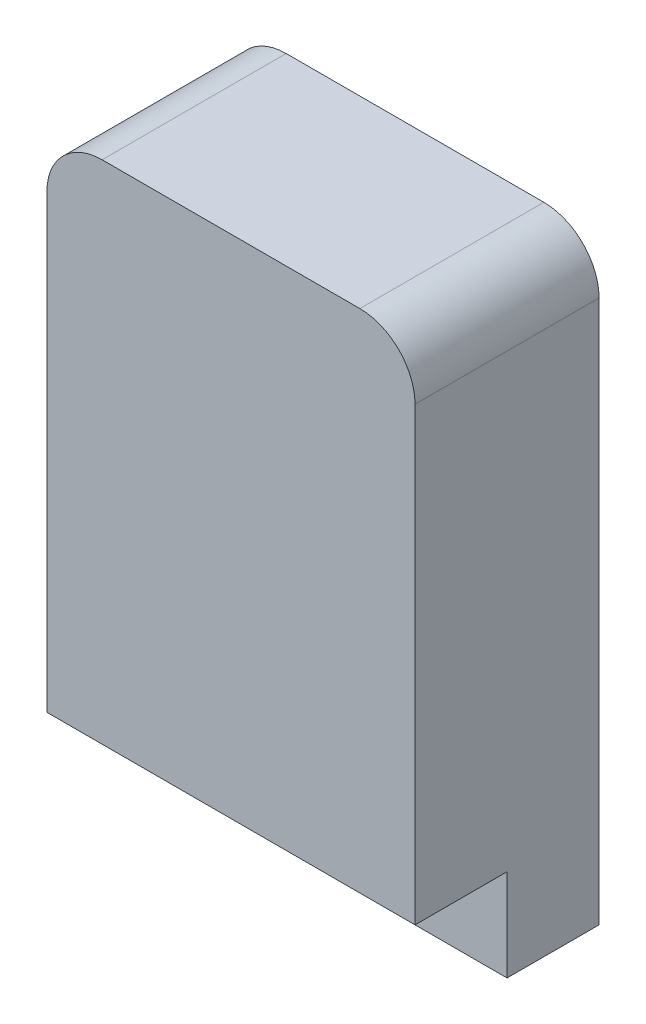
ISO-10303-21;
HEADER;
FILE_DESCRIPTION(('STEP AP214'),'2;1');
FILE_NAME('part.step','',(''),(''),'','','');
FILE_SCHEMA(('AUTOMOTIVE_DESIGN { 1 0 10303 214 1 1 1 1 }'));
ENDSEC;
DATA;
#1=APPLICATION_CONTEXT('core data for automotive mechanical design processes');
#2=APPLICATION_PROTOCOL_DEFINITION('international standard','automotive_design',2000,#1);
#3=PRODUCT_CONTEXT('',#1,'mechanical');
#4=PRODUCT('Part','Part','',(#3));
#5=PRODUCT_RELATED_PRODUCT_CATEGORY('part','',(#4));
#6=PRODUCT_DEFINITION_FORMATION('','',#4);
#7=PRODUCT_DEFINITION_CONTEXT('part definition',#1,'design');
#8=PRODUCT_DEFINITION('design','',#6,#7);
#9=PRODUCT_DEFINITION_SHAPE('','',#8);
#10=(LENGTH_UNIT() NAMED_UNIT(*) SI_UNIT(.MILLI.,.METRE.));
#11=(NAMED_UNIT(*) PLANE_ANGLE_UNIT() SI_UNIT($,.RADIAN.));
#12=(NAMED_UNIT(*) SI_UNIT($,.STERADIAN.) SOLID_ANGLE_UNIT());
#13=UNCERTAINTY_MEASURE_WITH_UNIT(LENGTH_MEASURE(1.E-05),#10,'distance_accuracy_value','');
#14=(GEOMETRIC_REPRESENTATION_CONTEXT(3) GLOBAL_UNCERTAINTY_ASSIGNED_CONTEXT((#13)) GLOBAL_UNIT_ASSIGNED_CONTEXT((#10,
#11,#12)) REPRESENTATION_CONTEXT('',''));
#15=CARTESIAN_POINT('',(0.,0.,0.));
#16=DIRECTION('',(0.,0.,1.));
#17=DIRECTION('',(1.,0.,0.));
#18=AXIS2_PLACEMENT_3D('',#15,#16,#17);
#19=CARTESIAN_POINT('',(0.,10.,10.));
#20=DIRECTION('',(0.,1.,0.));
#21=DIRECTION('',(0.,0.,1.));
#22=AXIS2_PLACEMENT_3D('',#19,#20,#21);
#23=PLANE('',#22);
#24=DIRECTION('',(1.,0.,0.));
#25=VECTOR('',#24,1.);
#26=CARTESIAN_POINT('',(0.,10.,0.));
#27=LINE('',#26,#25);
#28=CARTESIAN_POINT('',(-6.99999999999998,10.,0.));
#29=VERTEX_POINT('',#28);
#30=CARTESIAN_POINT('',(6.99999999999998,10.,0.));
#31=VERTEX_POINT('',#30);
#32=EDGE_CURVE('E124',#29,#31,#27,.T.);
#33=ORIENTED_EDGE('',*,*,#32,.F.);
#34=DIRECTION('',(0.,0.,-1.));
#35=VECTOR('',#34,1.);
#36=CARTESIAN_POINT('',(-6.99999999999998,10.,10.));
#37=LINE('',#36,#35);
#38=CARTESIAN_POINT('',(-6.99999999999998,10.,10.));
#39=VERTEX_POINT('',#38);
#40=EDGE_CURVE('E12',#39,#29,#37,.T.);
#41=ORIENTED_EDGE('',*,*,#40,.F.);
#42=DIRECTION('',(1.,0.,0.));
#43=VECTOR('',#42,1.);
#44=CARTESIAN_POINT('',(0.,10.,10.));
#45=LINE('',#44,#43);
#46=CARTESIAN_POINT('',(6.99999999999998,10.,10.));
#47=VERTEX_POINT('',#46);
#48=EDGE_CURVE('E138',#39,#47,#45,.T.);
#49=ORIENTED_EDGE('',*,*,#48,.T.);
#50=DIRECTION('',(0.,0.,-1.));
#51=VECTOR('',#50,1.);
#52=CARTESIAN_POINT('',(6.99999999999998,10.,10.));
#53=LINE('',#52,#51);
#54=EDGE_CURVE('E82',#47,#31,#53,.T.);
#55=ORIENTED_EDGE('',*,*,#54,.T.);
#56=EDGE_LOOP('',(#33,#41,#49,#55));
#57=FACE_BOUND('',#56,.T.);
#58=ADVANCED_FACE('F39',(#57),#23,.T.);
#59=CARTESIAN_POINT('',(-7.,7.,10.));
#60=DIRECTION('',(0.,0.,-1.));
#61=DIRECTION('',(-1.,0.,0.));
#62=AXIS2_PLACEMENT_3D('',#59,#60,#61);
#63=CYLINDRICAL_SURFACE('',#62,3.);
#64=CARTESIAN_POINT('',(-7.,7.,0.));
#65=DIRECTION('',(0.,0.,1.));
#66=DIRECTION('',(1.,0.,0.));
#67=AXIS2_PLACEMENT_3D('',#64,#65,#66);
#68=CIRCLE('',#67,3.);
#69=CARTESIAN_POINT('',(-10.,6.99999999999998,0.));
#70=VERTEX_POINT('',#69);
#71=EDGE_CURVE('E127',#29,#70,#68,.T.);
#72=ORIENTED_EDGE('',*,*,#71,.T.);
#73=DIRECTION('',(0.,0.,-1.));
#74=VECTOR('',#73,1.);
#75=CARTESIAN_POINT('',(-10.,6.99999999999998,10.));
#76=LINE('',#75,#74);
#77=CARTESIAN_POINT('',(-10.,6.99999999999998,10.));
#78=VERTEX_POINT('',#77);
#79=EDGE_CURVE('E46',#78,#70,#76,.T.);
#80=ORIENTED_EDGE('',*,*,#79,.F.);
#81=CARTESIAN_POINT('',(-7.,7.,10.));
#82=DIRECTION('',(0.,0.,1.));
#83=DIRECTION('',(1.,0.,0.));
#84=AXIS2_PLACEMENT_3D('',#81,#82,#83);
#85=CIRCLE('',#84,3.);
#86=EDGE_CURVE('E175',#39,#78,#85,.T.);
#87=ORIENTED_EDGE('',*,*,#86,.F.);
#88=ORIENTED_EDGE('',*,*,#40,.T.);
#89=EDGE_LOOP('',(#72,#80,#87,#88));
#90=FACE_BOUND('',#89,.T.);
#91=ADVANCED_FACE('F150',(#90),#63,.T.);
#92=CARTESIAN_POINT('',(-10.,0.,10.));
#93=DIRECTION('',(-1.,0.,0.));
#94=DIRECTION('',(0.,0.,1.));
#95=AXIS2_PLACEMENT_3D('',#92,#93,#94);
#96=PLANE('',#95);
#97=DIRECTION('',(0.,1.,0.));
#98=VECTOR('',#97,1.);
#99=CARTESIAN_POINT('',(-10.,0.,0.));
#100=LINE('',#99,#98);
#101=CARTESIAN_POINT('',(-10.,-22.5,0.));
#102=VERTEX_POINT('',#101);
#103=EDGE_CURVE('E131',#102,#70,#100,.T.);
#104=ORIENTED_EDGE('',*,*,#103,.F.);
#105=DIRECTION('',(0.,0.,-1.));
#106=VECTOR('',#105,1.);
#107=CARTESIAN_POINT('',(-10.,-22.5,5.));
#108=LINE('',#107,#106);
#109=CARTESIAN_POINT('',(-10.,-22.5,5.));
#110=VERTEX_POINT('',#109);
#111=EDGE_CURVE('E128',#110,#102,#108,.T.);
#112=ORIENTED_EDGE('',*,*,#111,.F.);
#113=DIRECTION('',(0.,-1.,0.));
#114=VECTOR('',#113,1.);
#115=CARTESIAN_POINT('',(-10.,0.,5.));
#116=LINE('',#115,#114);
#117=CARTESIAN_POINT('',(-10.,-17.5,5.));
#118=VERTEX_POINT('',#117);
#119=EDGE_CURVE('E219',#118,#110,#116,.T.);
#120=ORIENTED_EDGE('',*,*,#119,.F.);
#121=DIRECTION('',(0.,0.,-1.));
#122=VECTOR('',#121,1.);
#123=CARTESIAN_POINT('',(-10.,-17.5,10.));
#124=LINE('',#123,#122);
#125=CARTESIAN_POINT('',(-10.,-17.5,10.));
#126=VERTEX_POINT('',#125);
#127=EDGE_CURVE('E115',#126,#118,#124,.T.);
#128=ORIENTED_EDGE('',*,*,#127,.F.);
#129=DIRECTION('',(0.,1.,0.));
#130=VECTOR('',#129,1.);
#131=CARTESIAN_POINT('',(-10.,0.,10.));
#132=LINE('',#131,#130);
#133=EDGE_CURVE('E106',#126,#78,#132,.T.);
#134=ORIENTED_EDGE('',*,*,#133,.T.);
#135=ORIENTED_EDGE('',*,*,#79,.T.);
#136=EDGE_LOOP('',(#104,#112,#120,#128,#134,#135));
#137=FACE_BOUND('',#136,.T.);
#138=ADVANCED_FACE('F144',(#137),#96,.T.);
#139=CARTESIAN_POINT('',(0.,-17.5,10.));
#140=DIRECTION('',(0.,1.,0.));
#141=DIRECTION('',(0.,0.,1.));
#142=AXIS2_PLACEMENT_3D('',#139,#140,#141);
#143=PLANE('',#142);
#144=ORIENTED_EDGE('',*,*,#127,.T.);
#145=DIRECTION('',(1.,0.,0.));
#146=VECTOR('',#145,1.);
#147=CARTESIAN_POINT('',(0.,-17.5,5.));
#148=LINE('',#147,#146);
#149=CARTESIAN_POINT('',(10.,-17.5,5.));
#150=VERTEX_POINT('',#149);
#151=EDGE_CURVE('E113',#118,#150,#148,.T.);
#152=ORIENTED_EDGE('',*,*,#151,.T.);
#153=DIRECTION('',(0.,0.,-1.));
#154=VECTOR('',#153,1.);
#155=CARTESIAN_POINT('',(10.,-17.5,10.));
#156=LINE('',#155,#154);
#157=CARTESIAN_POINT('',(10.,-17.5,10.));
#158=VERTEX_POINT('',#157);
#159=EDGE_CURVE('E111',#158,#150,#156,.T.);
#160=ORIENTED_EDGE('',*,*,#159,.F.);
#161=DIRECTION('',(1.,0.,0.));
#162=VECTOR('',#161,1.);
#163=CARTESIAN_POINT('',(0.,-17.5,10.));
#164=LINE('',#163,#162);
#165=EDGE_CURVE('E99',#126,#158,#164,.T.);
#166=ORIENTED_EDGE('',*,*,#165,.F.);
#167=EDGE_LOOP('',(#144,#152,#160,#166));
#168=FACE_BOUND('',#167,.T.);
#169=ADVANCED_FACE('F112',(#168),#143,.F.);
#170=CARTESIAN_POINT('',(10.,0.,10.));
#171=DIRECTION('',(-1.,0.,0.));
#172=DIRECTION('',(0.,0.,1.));
#173=AXIS2_PLACEMENT_3D('',#170,#171,#172);
#174=PLANE('',#173);
#175=DIRECTION('',(0.,1.,0.));
#176=VECTOR('',#175,1.);
#177=CARTESIAN_POINT('',(10.,0.,0.));
#178=LINE('',#177,#176);
#179=CARTESIAN_POINT('',(10.,-22.5,0.));
#180=VERTEX_POINT('',#179);
#181=CARTESIAN_POINT('',(10.,6.99999999999998,0.));
#182=VERTEX_POINT('',#181);
#183=EDGE_CURVE('E134',#180,#182,#178,.T.);
#184=ORIENTED_EDGE('',*,*,#183,.T.);
#185=DIRECTION('',(0.,0.,-1.));
#186=VECTOR('',#185,1.);
#187=CARTESIAN_POINT('',(10.,6.99999999999998,10.));
#188=LINE('',#187,#186);
#189=CARTESIAN_POINT('',(10.,6.99999999999998,10.));
#190=VERTEX_POINT('',#189);
#191=EDGE_CURVE('E116',#190,#182,#188,.T.);
#192=ORIENTED_EDGE('',*,*,#191,.F.);
#193=DIRECTION('',(0.,1.,0.));
#194=VECTOR('',#193,1.);
#195=CARTESIAN_POINT('',(10.,0.,10.));
#196=LINE('',#195,#194);
#197=EDGE_CURVE('E103',#158,#190,#196,.T.);
#198=ORIENTED_EDGE('',*,*,#197,.F.);
#199=ORIENTED_EDGE('',*,*,#159,.T.);
#200=DIRECTION('',(0.,-1.,0.));
#201=VECTOR('',#200,1.);
#202=CARTESIAN_POINT('',(10.,0.,5.));
#203=LINE('',#202,#201);
#204=CARTESIAN_POINT('',(10.,-22.5,5.));
#205=VERTEX_POINT('',#204);
#206=EDGE_CURVE('E53',#150,#205,#203,.T.);
#207=ORIENTED_EDGE('',*,*,#206,.T.);
#208=DIRECTION('',(0.,0.,-1.));
#209=VECTOR('',#208,1.);
#210=CARTESIAN_POINT('',(10.,-22.5,5.));
#211=LINE('',#210,#209);
#212=EDGE_CURVE('E171',#205,#180,#211,.T.);
#213=ORIENTED_EDGE('',*,*,#212,.T.);
#214=EDGE_LOOP('',(#184,#192,#198,#199,#207,#213));
#215=FACE_BOUND('',#214,.T.);
#216=ADVANCED_FACE('F118',(#215),#174,.F.);
#217=CARTESIAN_POINT('',(7.,7.,10.));
#218=DIRECTION('',(0.,0.,-1.));
#219=DIRECTION('',(-1.,0.,0.));
#220=AXIS2_PLACEMENT_3D('',#217,#218,#219);
#221=CYLINDRICAL_SURFACE('',#220,3.);
#222=CARTESIAN_POINT('',(7.,7.,0.));
#223=DIRECTION('',(0.,0.,1.));
#224=DIRECTION('',(1.,0.,0.));
#225=AXIS2_PLACEMENT_3D('',#222,#223,#224);
#226=CIRCLE('',#225,3.);
#227=EDGE_CURVE('E136',#182,#31,#226,.T.);
#228=ORIENTED_EDGE('',*,*,#227,.T.);
#229=ORIENTED_EDGE('',*,*,#54,.F.);
#230=CARTESIAN_POINT('',(7.,7.,10.));
#231=DIRECTION('',(0.,0.,1.));
#232=DIRECTION('',(1.,0.,0.));
#233=AXIS2_PLACEMENT_3D('',#230,#231,#232);
#234=CIRCLE('',#233,3.);
#235=EDGE_CURVE('E62',#190,#47,#234,.T.);
#236=ORIENTED_EDGE('',*,*,#235,.F.);
#237=ORIENTED_EDGE('',*,*,#191,.T.);
#238=EDGE_LOOP('',(#228,#229,#236,#237));
#239=FACE_BOUND('',#238,.T.);
#240=ADVANCED_FACE('F189',(#239),#221,.T.);
#241=CARTESIAN_POINT('',(0.,0.,10.));
#242=DIRECTION('',(0.,0.,1.));
#243=DIRECTION('',(1.,0.,0.));
#244=AXIS2_PLACEMENT_3D('',#241,#242,#243);
#245=PLANE('',#244);
#246=ORIENTED_EDGE('',*,*,#48,.F.);
#247=ORIENTED_EDGE('',*,*,#86,.T.);
#248=ORIENTED_EDGE('',*,*,#133,.F.);
#249=ORIENTED_EDGE('',*,*,#165,.T.);
#250=ORIENTED_EDGE('',*,*,#197,.T.);
#251=ORIENTED_EDGE('',*,*,#235,.T.);
#252=EDGE_LOOP('',(#246,#247,#248,#249,#250,#251));
#253=FACE_BOUND('',#252,.T.);
#254=ADVANCED_FACE('F101',(#253),#245,.T.);
#255=CARTESIAN_POINT('',(0.,0.,0.));
#256=DIRECTION('',(0.,0.,1.));
#257=DIRECTION('',(1.,0.,0.));
#258=AXIS2_PLACEMENT_3D('',#255,#256,#257);
#259=PLANE('',#258);
#260=CARTESIAN_POINT('',(0.,0.,0.));
#261=DIRECTION('',(0.,0.,1.));
#262=DIRECTION('',(1.,0.,0.));
#263=AXIS2_PLACEMENT_3D('',#260,#261,#262);
#264=CIRCLE('',#263,7.5);
#265=CARTESIAN_POINT('',(7.5,0.,0.));
#266=VERTEX_POINT('',#265);
#267=EDGE_CURVE('E165',#266,#266,#264,.T.);
#268=ORIENTED_EDGE('',*,*,#267,.T.);
#269=EDGE_LOOP('',(#268));
#270=FACE_BOUND('',#269,.T.);
#271=ORIENTED_EDGE('',*,*,#32,.T.);
#272=ORIENTED_EDGE('',*,*,#227,.F.);
#273=ORIENTED_EDGE('',*,*,#183,.F.);
#274=DIRECTION('',(1.,0.,0.));
#275=VECTOR('',#274,1.);
#276=CARTESIAN_POINT('',(0.,-22.5,0.));
#277=LINE('',#276,#275);
#278=EDGE_CURVE('E156',#102,#180,#277,.T.);
#279=ORIENTED_EDGE('',*,*,#278,.F.);
#280=ORIENTED_EDGE('',*,*,#103,.T.);
#281=ORIENTED_EDGE('',*,*,#71,.F.);
#282=EDGE_LOOP('',(#271,#272,#273,#279,#280,#281));
#283=FACE_BOUND('',#282,.T.);
#284=ADVANCED_FACE('F153',(#270,#283),#259,.F.);
#285=CARTESIAN_POINT('',(0.,-22.5,5.));
#286=DIRECTION('',(0.,1.,0.));
#287=DIRECTION('',(0.,0.,1.));
#288=AXIS2_PLACEMENT_3D('',#285,#286,#287);
#289=PLANE('',#288);
#290=ORIENTED_EDGE('',*,*,#278,.T.);
#291=ORIENTED_EDGE('',*,*,#212,.F.);
#292=DIRECTION('',(1.,0.,0.));
#293=VECTOR('',#292,1.);
#294=CARTESIAN_POINT('',(0.,-22.5,5.));
#295=LINE('',#294,#293);
#296=EDGE_CURVE('E169',#110,#205,#295,.T.);
#297=ORIENTED_EDGE('',*,*,#296,.F.);
#298=ORIENTED_EDGE('',*,*,#111,.T.);
#299=EDGE_LOOP('',(#290,#291,#297,#298));
#300=FACE_BOUND('',#299,.T.);
#301=ADVANCED_FACE('F195',(#300),#289,.F.);
#302=CARTESIAN_POINT('',(0.,0.,5.));
#303=DIRECTION('',(0.,0.,1.));
#304=DIRECTION('',(1.,0.,0.));
#305=AXIS2_PLACEMENT_3D('',#302,#303,#304);
#306=PLANE('',#305);
#307=ORIENTED_EDGE('',*,*,#206,.F.);
#308=ORIENTED_EDGE('',*,*,#151,.F.);
#309=ORIENTED_EDGE('',*,*,#119,.T.);
#310=ORIENTED_EDGE('',*,*,#296,.T.);
#311=EDGE_LOOP('',(#307,#308,#309,#310));
#312=FACE_BOUND('',#311,.T.);
#313=ADVANCED_FACE('F201',(#312),#306,.T.);
#314=CARTESIAN_POINT('',(0.,0.,5.));
#315=DIRECTION('',(0.,0.,-1.));
#316=DIRECTION('',(-1.,0.,0.));
#317=AXIS2_PLACEMENT_3D('',#314,#315,#316);
#318=CYLINDRICAL_SURFACE('',#317,7.5);
#319=CARTESIAN_POINT('',(0.,0.,5.));
#320=DIRECTION('',(0.,0.,1.));
#321=DIRECTION('',(1.,0.,0.));
#322=AXIS2_PLACEMENT_3D('',#319,#320,#321);
#323=CIRCLE('',#322,7.5);
#324=CARTESIAN_POINT('',(7.5,0.,5.));
#325=VERTEX_POINT('',#324);
#326=EDGE_CURVE('E161',#325,#325,#323,.T.);
#327=ORIENTED_EDGE('',*,*,#326,.T.);
#328=EDGE_LOOP('',(#327));
#329=FACE_BOUND('',#328,.T.);
#330=ORIENTED_EDGE('',*,*,#267,.F.);
#331=EDGE_LOOP('',(#330));
#332=FACE_BOUND('',#331,.T.);
#333=ADVANCED_FACE('F204',(#329,#332),#318,.F.);
#334=CARTESIAN_POINT('',(0.,0.,5.));
#335=DIRECTION('',(0.,0.,1.));
#336=DIRECTION('',(1.,0.,0.));
#337=AXIS2_PLACEMENT_3D('',#334,#335,#336);
#338=PLANE('',#337);
#339=ORIENTED_EDGE('',*,*,#326,.F.);
#340=EDGE_LOOP('',(#339));
#341=FACE_BOUND('',#340,.T.);
#342=ADVANCED_FACE('F207',(#341),#338,.F.);
#343=CLOSED_SHELL('',(#58,#91,#138,#169,#216,#240,#254,#284,#301,#313,#333,#342));
#344=MANIFOLD_SOLID_BREP('B2',#343);
#345=ADVANCED_BREP_SHAPE_REPRESENTATION('',(#18,#344),#14);
#346=SHAPE_DEFINITION_REPRESENTATION(#9,#345);
ENDSEC;
END-ISO-10303-21;
